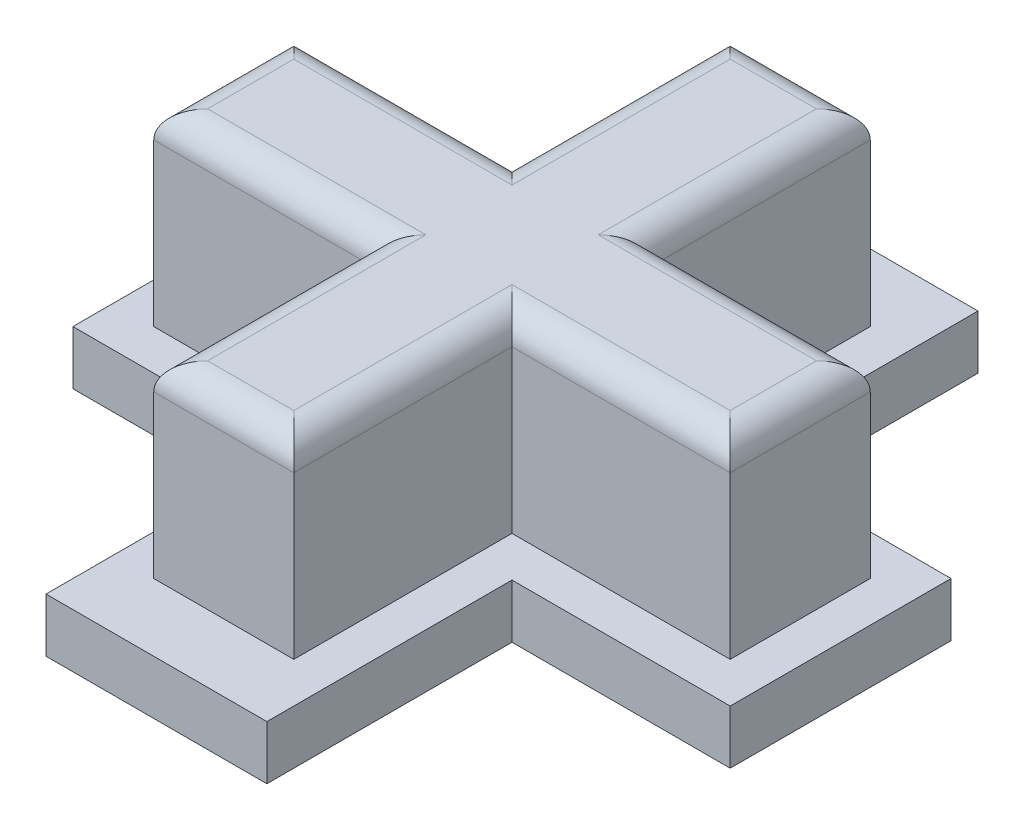
ISO-10303-21;
HEADER;
FILE_DESCRIPTION(('STEP AP214'),'2;1');
FILE_NAME('part.step','',(''),(''),'','','');
FILE_SCHEMA(('AUTOMOTIVE_DESIGN { 1 0 10303 214 1 1 1 1 }'));
ENDSEC;
DATA;
#1=APPLICATION_CONTEXT('core data for automotive mechanical design processes');
#2=APPLICATION_PROTOCOL_DEFINITION('international standard','automotive_design',2000,#1);
#3=PRODUCT_CONTEXT('',#1,'mechanical');
#4=PRODUCT('Part','Part','',(#3));
#5=PRODUCT_RELATED_PRODUCT_CATEGORY('part','',(#4));
#6=PRODUCT_DEFINITION_FORMATION('','',#4);
#7=PRODUCT_DEFINITION_CONTEXT('part definition',#1,'design');
#8=PRODUCT_DEFINITION('design','',#6,#7);
#9=PRODUCT_DEFINITION_SHAPE('','',#8);
#10=(LENGTH_UNIT() NAMED_UNIT(*) SI_UNIT(.MILLI.,.METRE.));
#11=(NAMED_UNIT(*) PLANE_ANGLE_UNIT() SI_UNIT($,.RADIAN.));
#12=(NAMED_UNIT(*) SI_UNIT($,.STERADIAN.) SOLID_ANGLE_UNIT());
#13=UNCERTAINTY_MEASURE_WITH_UNIT(LENGTH_MEASURE(1.E-05),#10,'distance_accuracy_value','');
#14=(GEOMETRIC_REPRESENTATION_CONTEXT(3) GLOBAL_UNCERTAINTY_ASSIGNED_CONTEXT((#13)) GLOBAL_UNIT_ASSIGNED_CONTEXT((#10,
#11,#12)) REPRESENTATION_CONTEXT('',''));
#15=CARTESIAN_POINT('',(0.,0.,0.));
#16=DIRECTION('',(0.,0.,1.));
#17=DIRECTION('',(1.,0.,0.));
#18=AXIS2_PLACEMENT_3D('',#15,#16,#17);
#19=CARTESIAN_POINT('',(0.,2.,0.));
#20=DIRECTION('',(0.,1.,0.));
#21=DIRECTION('',(0.,0.,1.));
#22=AXIS2_PLACEMENT_3D('',#19,#20,#21);
#23=PLANE('',#22);
#24=DIRECTION('',(0.,0.,1.));
#25=VECTOR('',#24,1.);
#26=CARTESIAN_POINT('',(4.1,2.,0.));
#27=LINE('',#26,#25);
#28=CARTESIAN_POINT('',(4.1,2.,4.1));
#29=VERTEX_POINT('',#28);
#30=CARTESIAN_POINT('',(4.1,2.,13.2));
#31=VERTEX_POINT('',#30);
#32=EDGE_CURVE('E308',#29,#31,#27,.T.);
#33=ORIENTED_EDGE('',*,*,#32,.F.);
#34=DIRECTION('',(-1.,0.,0.));
#35=VECTOR('',#34,1.);
#36=CARTESIAN_POINT('',(0.,2.,4.1));
#37=LINE('',#36,#35);
#38=CARTESIAN_POINT('',(12.2,2.,4.1));
#39=VERTEX_POINT('',#38);
#40=EDGE_CURVE('E311',#39,#29,#37,.T.);
#41=ORIENTED_EDGE('',*,*,#40,.F.);
#42=DIRECTION('',(0.,0.,1.));
#43=VECTOR('',#42,1.);
#44=CARTESIAN_POINT('',(12.2,2.,0.));
#45=LINE('',#44,#43);
#46=CARTESIAN_POINT('',(12.2,2.,-4.1));
#47=VERTEX_POINT('',#46);
#48=EDGE_CURVE('E315',#47,#39,#45,.T.);
#49=ORIENTED_EDGE('',*,*,#48,.F.);
#50=DIRECTION('',(-1.,0.,0.));
#51=VECTOR('',#50,1.);
#52=CARTESIAN_POINT('',(0.,2.,-4.1));
#53=LINE('',#52,#51);
#54=CARTESIAN_POINT('',(4.1,2.,-4.1));
#55=VERTEX_POINT('',#54);
#56=EDGE_CURVE('E318',#47,#55,#53,.T.);
#57=ORIENTED_EDGE('',*,*,#56,.T.);
#58=DIRECTION('',(0.,0.,1.));
#59=VECTOR('',#58,1.);
#60=CARTESIAN_POINT('',(4.1,2.,0.));
#61=LINE('',#60,#59);
#62=CARTESIAN_POINT('',(4.1,2.,-13.2));
#63=VERTEX_POINT('',#62);
#64=EDGE_CURVE('E320',#63,#55,#61,.T.);
#65=ORIENTED_EDGE('',*,*,#64,.F.);
#66=DIRECTION('',(1.,0.,0.));
#67=VECTOR('',#66,1.);
#68=CARTESIAN_POINT('',(0.,2.,-13.2));
#69=LINE('',#68,#67);
#70=CARTESIAN_POINT('',(-4.1,2.,-13.2));
#71=VERTEX_POINT('',#70);
#72=EDGE_CURVE('E323',#71,#63,#69,.T.);
#73=ORIENTED_EDGE('',*,*,#72,.F.);
#74=DIRECTION('',(0.,0.,1.));
#75=VECTOR('',#74,1.);
#76=CARTESIAN_POINT('',(-4.1,2.,0.));
#77=LINE('',#76,#75);
#78=CARTESIAN_POINT('',(-4.1,2.,-4.1));
#79=VERTEX_POINT('',#78);
#80=EDGE_CURVE('E326',#71,#79,#77,.T.);
#81=ORIENTED_EDGE('',*,*,#80,.T.);
#82=DIRECTION('',(-1.,0.,0.));
#83=VECTOR('',#82,1.);
#84=CARTESIAN_POINT('',(0.,2.,-4.1));
#85=LINE('',#84,#83);
#86=CARTESIAN_POINT('',(-12.2,2.,-4.1));
#87=VERTEX_POINT('',#86);
#88=EDGE_CURVE('E328',#79,#87,#85,.T.);
#89=ORIENTED_EDGE('',*,*,#88,.T.);
#90=DIRECTION('',(0.,0.,1.));
#91=VECTOR('',#90,1.);
#92=CARTESIAN_POINT('',(-12.2,2.,0.));
#93=LINE('',#92,#91);
#94=CARTESIAN_POINT('',(-12.2,2.,4.1));
#95=VERTEX_POINT('',#94);
#96=EDGE_CURVE('E330',#87,#95,#93,.T.);
#97=ORIENTED_EDGE('',*,*,#96,.T.);
#98=DIRECTION('',(1.,0.,0.));
#99=VECTOR('',#98,1.);
#100=CARTESIAN_POINT('',(0.,2.,4.1));
#101=LINE('',#100,#99);
#102=CARTESIAN_POINT('',(-4.1,2.,4.1));
#103=VERTEX_POINT('',#102);
#104=EDGE_CURVE('E332',#95,#103,#101,.T.);
#105=ORIENTED_EDGE('',*,*,#104,.T.);
#106=DIRECTION('',(0.,0.,1.));
#107=VECTOR('',#106,1.);
#108=CARTESIAN_POINT('',(-4.1,2.,0.));
#109=LINE('',#108,#107);
#110=CARTESIAN_POINT('',(-4.1,2.,13.2));
#111=VERTEX_POINT('',#110);
#112=EDGE_CURVE('E334',#103,#111,#109,.T.);
#113=ORIENTED_EDGE('',*,*,#112,.T.);
#114=DIRECTION('',(1.,0.,0.));
#115=VECTOR('',#114,1.);
#116=CARTESIAN_POINT('',(0.,2.,13.2));
#117=LINE('',#116,#115);
#118=EDGE_CURVE('E336',#111,#31,#117,.T.);
#119=ORIENTED_EDGE('',*,*,#118,.T.);
#120=EDGE_LOOP('',(#33,#41,#49,#57,#65,#73,#81,#89,#97,#105,#113,#119));
#121=FACE_BOUND('',#120,.T.);
#122=DIRECTION('',(-1.,0.,0.));
#123=VECTOR('',#122,1.);
#124=CARTESIAN_POINT('',(2.6,2.,-10.7));
#125=LINE('',#124,#123);
#126=CARTESIAN_POINT('',(2.6,2.,-10.7));
#127=VERTEX_POINT('',#126);
#128=CARTESIAN_POINT('',(-2.6,2.,-10.7));
#129=VERTEX_POINT('',#128);
#130=EDGE_CURVE('E257',#127,#129,#125,.T.);
#131=ORIENTED_EDGE('',*,*,#130,.F.);
#132=DIRECTION('',(0.,0.,-1.));
#133=VECTOR('',#132,1.);
#134=CARTESIAN_POINT('',(2.6,2.,-10.7));
#135=LINE('',#134,#133);
#136=CARTESIAN_POINT('',(2.6,2.,-2.6));
#137=VERTEX_POINT('',#136);
#138=EDGE_CURVE('E238',#137,#127,#135,.T.);
#139=ORIENTED_EDGE('',*,*,#138,.F.);
#140=DIRECTION('',(-1.,0.,0.));
#141=VECTOR('',#140,1.);
#142=CARTESIAN_POINT('',(10.7,2.,-2.6));
#143=LINE('',#142,#141);
#144=CARTESIAN_POINT('',(10.7,2.,-2.6));
#145=VERTEX_POINT('',#144);
#146=EDGE_CURVE('E247',#145,#137,#143,.T.);
#147=ORIENTED_EDGE('',*,*,#146,.F.);
#148=DIRECTION('',(0.,0.,-1.));
#149=VECTOR('',#148,1.);
#150=CARTESIAN_POINT('',(10.7,2.,2.6));
#151=LINE('',#150,#149);
#152=CARTESIAN_POINT('',(10.7,2.,2.6));
#153=VERTEX_POINT('',#152);
#154=EDGE_CURVE('E253',#153,#145,#151,.T.);
#155=ORIENTED_EDGE('',*,*,#154,.F.);
#156=DIRECTION('',(1.,0.,0.));
#157=VECTOR('',#156,1.);
#158=CARTESIAN_POINT('',(10.7,2.,2.6));
#159=LINE('',#158,#157);
#160=CARTESIAN_POINT('',(2.6,2.,2.6));
#161=VERTEX_POINT('',#160);
#162=EDGE_CURVE('E284',#161,#153,#159,.T.);
#163=ORIENTED_EDGE('',*,*,#162,.F.);
#164=DIRECTION('',(0.,0.,-1.));
#165=VECTOR('',#164,1.);
#166=CARTESIAN_POINT('',(2.6,2.,2.6));
#167=LINE('',#166,#165);
#168=CARTESIAN_POINT('',(2.6,2.,10.7));
#169=VERTEX_POINT('',#168);
#170=EDGE_CURVE('E281',#169,#161,#167,.T.);
#171=ORIENTED_EDGE('',*,*,#170,.F.);
#172=DIRECTION('',(1.,0.,0.));
#173=VECTOR('',#172,1.);
#174=CARTESIAN_POINT('',(2.6,2.,10.7));
#175=LINE('',#174,#173);
#176=CARTESIAN_POINT('',(-2.6,2.,10.7));
#177=VERTEX_POINT('',#176);
#178=EDGE_CURVE('E278',#177,#169,#175,.T.);
#179=ORIENTED_EDGE('',*,*,#178,.F.);
#180=DIRECTION('',(0.,0.,1.));
#181=VECTOR('',#180,1.);
#182=CARTESIAN_POINT('',(-2.6,2.,2.6));
#183=LINE('',#182,#181);
#184=CARTESIAN_POINT('',(-2.6,2.,2.6));
#185=VERTEX_POINT('',#184);
#186=EDGE_CURVE('E275',#185,#177,#183,.T.);
#187=ORIENTED_EDGE('',*,*,#186,.F.);
#188=DIRECTION('',(1.,0.,0.));
#189=VECTOR('',#188,1.);
#190=CARTESIAN_POINT('',(-2.6,2.,2.6));
#191=LINE('',#190,#189);
#192=CARTESIAN_POINT('',(-10.7,2.,2.6));
#193=VERTEX_POINT('',#192);
#194=EDGE_CURVE('E272',#193,#185,#191,.T.);
#195=ORIENTED_EDGE('',*,*,#194,.F.);
#196=DIRECTION('',(0.,0.,1.));
#197=VECTOR('',#196,1.);
#198=CARTESIAN_POINT('',(-10.7,2.,2.6));
#199=LINE('',#198,#197);
#200=CARTESIAN_POINT('',(-10.7,2.,-2.6));
#201=VERTEX_POINT('',#200);
#202=EDGE_CURVE('E269',#201,#193,#199,.T.);
#203=ORIENTED_EDGE('',*,*,#202,.F.);
#204=DIRECTION('',(-1.,0.,0.));
#205=VECTOR('',#204,1.);
#206=CARTESIAN_POINT('',(-5.5,2.,-2.6));
#207=LINE('',#206,#205);
#208=CARTESIAN_POINT('',(-2.6,2.,-2.6));
#209=VERTEX_POINT('',#208);
#210=EDGE_CURVE('E266',#209,#201,#207,.T.);
#211=ORIENTED_EDGE('',*,*,#210,.F.);
#212=DIRECTION('',(0.,0.,1.));
#213=VECTOR('',#212,1.);
#214=CARTESIAN_POINT('',(-2.6,2.,-10.7));
#215=LINE('',#214,#213);
#216=EDGE_CURVE('E259',#129,#209,#215,.T.);
#217=ORIENTED_EDGE('',*,*,#216,.F.);
#218=EDGE_LOOP('',(#131,#139,#147,#155,#163,#171,#179,#187,#195,#203,#211,#217));
#219=FACE_BOUND('',#218,.T.);
#220=ADVANCED_FACE('F35',(#121,#219),#23,.T.);
#221=CARTESIAN_POINT('',(4.1,2.,0.));
#222=DIRECTION('',(1.,0.,0.));
#223=DIRECTION('',(0.,0.,-1.));
#224=AXIS2_PLACEMENT_3D('',#221,#222,#223);
#225=PLANE('',#224);
#226=DIRECTION('',(0.,0.,1.));
#227=VECTOR('',#226,1.);
#228=CARTESIAN_POINT('',(4.1,0.,0.));
#229=LINE('',#228,#227);
#230=CARTESIAN_POINT('',(4.1,0.,4.1));
#231=VERTEX_POINT('',#230);
#232=CARTESIAN_POINT('',(4.1,0.,13.2));
#233=VERTEX_POINT('',#232);
#234=EDGE_CURVE('E243',#231,#233,#229,.T.);
#235=ORIENTED_EDGE('',*,*,#234,.F.);
#236=DIRECTION('',(0.,-1.,0.));
#237=VECTOR('',#236,1.);
#238=CARTESIAN_POINT('',(4.1,2.,4.1));
#239=LINE('',#238,#237);
#240=EDGE_CURVE('E394',#29,#231,#239,.T.);
#241=ORIENTED_EDGE('',*,*,#240,.F.);
#242=ORIENTED_EDGE('',*,*,#32,.T.);
#243=DIRECTION('',(0.,-1.,0.));
#244=VECTOR('',#243,1.);
#245=CARTESIAN_POINT('',(4.1,2.,13.2));
#246=LINE('',#245,#244);
#247=EDGE_CURVE('E338',#31,#233,#246,.T.);
#248=ORIENTED_EDGE('',*,*,#247,.T.);
#249=EDGE_LOOP('',(#235,#241,#242,#248));
#250=FACE_BOUND('',#249,.T.);
#251=ADVANCED_FACE('F508',(#250),#225,.T.);
#252=CARTESIAN_POINT('',(0.,2.,4.1));
#253=DIRECTION('',(0.,0.,1.));
#254=DIRECTION('',(1.,0.,0.));
#255=AXIS2_PLACEMENT_3D('',#252,#253,#254);
#256=PLANE('',#255);
#257=DIRECTION('',(-1.,0.,0.));
#258=VECTOR('',#257,1.);
#259=CARTESIAN_POINT('',(0.,0.,4.1));
#260=LINE('',#259,#258);
#261=CARTESIAN_POINT('',(12.2,0.,4.1));
#262=VERTEX_POINT('',#261);
#263=EDGE_CURVE('E341',#262,#231,#260,.T.);
#264=ORIENTED_EDGE('',*,*,#263,.F.);
#265=DIRECTION('',(0.,-1.,0.));
#266=VECTOR('',#265,1.);
#267=CARTESIAN_POINT('',(12.2,2.,4.1));
#268=LINE('',#267,#266);
#269=EDGE_CURVE('E392',#39,#262,#268,.T.);
#270=ORIENTED_EDGE('',*,*,#269,.F.);
#271=ORIENTED_EDGE('',*,*,#40,.T.);
#272=ORIENTED_EDGE('',*,*,#240,.T.);
#273=EDGE_LOOP('',(#264,#270,#271,#272));
#274=FACE_BOUND('',#273,.T.);
#275=ADVANCED_FACE('F514',(#274),#256,.T.);
#276=CARTESIAN_POINT('',(12.2,2.,0.));
#277=DIRECTION('',(1.,0.,0.));
#278=DIRECTION('',(0.,0.,-1.));
#279=AXIS2_PLACEMENT_3D('',#276,#277,#278);
#280=PLANE('',#279);
#281=DIRECTION('',(0.,0.,1.));
#282=VECTOR('',#281,1.);
#283=CARTESIAN_POINT('',(12.2,0.,0.));
#284=LINE('',#283,#282);
#285=CARTESIAN_POINT('',(12.2,0.,-4.1));
#286=VERTEX_POINT('',#285);
#287=EDGE_CURVE('E344',#286,#262,#284,.T.);
#288=ORIENTED_EDGE('',*,*,#287,.F.);
#289=DIRECTION('',(0.,-1.,0.));
#290=VECTOR('',#289,1.);
#291=CARTESIAN_POINT('',(12.2,2.,-4.1));
#292=LINE('',#291,#290);
#293=EDGE_CURVE('E390',#47,#286,#292,.T.);
#294=ORIENTED_EDGE('',*,*,#293,.F.);
#295=ORIENTED_EDGE('',*,*,#48,.T.);
#296=ORIENTED_EDGE('',*,*,#269,.T.);
#297=EDGE_LOOP('',(#288,#294,#295,#296));
#298=FACE_BOUND('',#297,.T.);
#299=ADVANCED_FACE('F560',(#298),#280,.T.);
#300=CARTESIAN_POINT('',(0.,2.,-4.1));
#301=DIRECTION('',(0.,0.,1.));
#302=DIRECTION('',(1.,0.,0.));
#303=AXIS2_PLACEMENT_3D('',#300,#301,#302);
#304=PLANE('',#303);
#305=DIRECTION('',(-1.,0.,0.));
#306=VECTOR('',#305,1.);
#307=CARTESIAN_POINT('',(0.,0.,-4.1));
#308=LINE('',#307,#306);
#309=CARTESIAN_POINT('',(4.1,0.,-4.1));
#310=VERTEX_POINT('',#309);
#311=EDGE_CURVE('E347',#286,#310,#308,.T.);
#312=ORIENTED_EDGE('',*,*,#311,.T.);
#313=DIRECTION('',(0.,-1.,0.));
#314=VECTOR('',#313,1.);
#315=CARTESIAN_POINT('',(4.1,2.,-4.1));
#316=LINE('',#315,#314);
#317=EDGE_CURVE('E388',#55,#310,#316,.T.);
#318=ORIENTED_EDGE('',*,*,#317,.F.);
#319=ORIENTED_EDGE('',*,*,#56,.F.);
#320=ORIENTED_EDGE('',*,*,#293,.T.);
#321=EDGE_LOOP('',(#312,#318,#319,#320));
#322=FACE_BOUND('',#321,.T.);
#323=ADVANCED_FACE('F556',(#322),#304,.F.);
#324=CARTESIAN_POINT('',(4.1,2.,0.));
#325=DIRECTION('',(1.,0.,0.));
#326=DIRECTION('',(0.,0.,-1.));
#327=AXIS2_PLACEMENT_3D('',#324,#325,#326);
#328=PLANE('',#327);
#329=DIRECTION('',(0.,0.,1.));
#330=VECTOR('',#329,1.);
#331=CARTESIAN_POINT('',(4.1,0.,0.));
#332=LINE('',#331,#330);
#333=CARTESIAN_POINT('',(4.1,0.,-13.2));
#334=VERTEX_POINT('',#333);
#335=EDGE_CURVE('E350',#334,#310,#332,.T.);
#336=ORIENTED_EDGE('',*,*,#335,.F.);
#337=DIRECTION('',(0.,-1.,0.));
#338=VECTOR('',#337,1.);
#339=CARTESIAN_POINT('',(4.1,2.,-13.2));
#340=LINE('',#339,#338);
#341=EDGE_CURVE('E386',#63,#334,#340,.T.);
#342=ORIENTED_EDGE('',*,*,#341,.F.);
#343=ORIENTED_EDGE('',*,*,#64,.T.);
#344=ORIENTED_EDGE('',*,*,#317,.T.);
#345=EDGE_LOOP('',(#336,#342,#343,#344));
#346=FACE_BOUND('',#345,.T.);
#347=ADVANCED_FACE('F552',(#346),#328,.T.);
#348=CARTESIAN_POINT('',(0.,2.,-13.2));
#349=DIRECTION('',(0.,0.,-1.));
#350=DIRECTION('',(-1.,0.,0.));
#351=AXIS2_PLACEMENT_3D('',#348,#349,#350);
#352=PLANE('',#351);
#353=DIRECTION('',(1.,0.,0.));
#354=VECTOR('',#353,1.);
#355=CARTESIAN_POINT('',(0.,0.,-13.2));
#356=LINE('',#355,#354);
#357=CARTESIAN_POINT('',(-4.1,0.,-13.2));
#358=VERTEX_POINT('',#357);
#359=EDGE_CURVE('E353',#358,#334,#356,.T.);
#360=ORIENTED_EDGE('',*,*,#359,.F.);
#361=DIRECTION('',(0.,-1.,0.));
#362=VECTOR('',#361,1.);
#363=CARTESIAN_POINT('',(-4.1,2.,-13.2));
#364=LINE('',#363,#362);
#365=EDGE_CURVE('E384',#71,#358,#364,.T.);
#366=ORIENTED_EDGE('',*,*,#365,.F.);
#367=ORIENTED_EDGE('',*,*,#72,.T.);
#368=ORIENTED_EDGE('',*,*,#341,.T.);
#369=EDGE_LOOP('',(#360,#366,#367,#368));
#370=FACE_BOUND('',#369,.T.);
#371=ADVANCED_FACE('F548',(#370),#352,.T.);
#372=CARTESIAN_POINT('',(-4.1,2.,0.));
#373=DIRECTION('',(1.,0.,0.));
#374=DIRECTION('',(0.,0.,-1.));
#375=AXIS2_PLACEMENT_3D('',#372,#373,#374);
#376=PLANE('',#375);
#377=DIRECTION('',(0.,0.,1.));
#378=VECTOR('',#377,1.);
#379=CARTESIAN_POINT('',(-4.1,0.,0.));
#380=LINE('',#379,#378);
#381=CARTESIAN_POINT('',(-4.1,0.,-4.1));
#382=VERTEX_POINT('',#381);
#383=EDGE_CURVE('E356',#358,#382,#380,.T.);
#384=ORIENTED_EDGE('',*,*,#383,.T.);
#385=DIRECTION('',(0.,-1.,0.));
#386=VECTOR('',#385,1.);
#387=CARTESIAN_POINT('',(-4.1,2.,-4.1));
#388=LINE('',#387,#386);
#389=EDGE_CURVE('E381',#79,#382,#388,.T.);
#390=ORIENTED_EDGE('',*,*,#389,.F.);
#391=ORIENTED_EDGE('',*,*,#80,.F.);
#392=ORIENTED_EDGE('',*,*,#365,.T.);
#393=EDGE_LOOP('',(#384,#390,#391,#392));
#394=FACE_BOUND('',#393,.T.);
#395=ADVANCED_FACE('F544',(#394),#376,.F.);
#396=CARTESIAN_POINT('',(0.,2.,-4.1));
#397=DIRECTION('',(0.,0.,1.));
#398=DIRECTION('',(1.,0.,0.));
#399=AXIS2_PLACEMENT_3D('',#396,#397,#398);
#400=PLANE('',#399);
#401=DIRECTION('',(-1.,0.,0.));
#402=VECTOR('',#401,1.);
#403=CARTESIAN_POINT('',(0.,0.,-4.1));
#404=LINE('',#403,#402);
#405=CARTESIAN_POINT('',(-12.2,0.,-4.1));
#406=VERTEX_POINT('',#405);
#407=EDGE_CURVE('E358',#382,#406,#404,.T.);
#408=ORIENTED_EDGE('',*,*,#407,.T.);
#409=DIRECTION('',(0.,-1.,0.));
#410=VECTOR('',#409,1.);
#411=CARTESIAN_POINT('',(-12.2,2.,-4.1));
#412=LINE('',#411,#410);
#413=EDGE_CURVE('E378',#87,#406,#412,.T.);
#414=ORIENTED_EDGE('',*,*,#413,.F.);
#415=ORIENTED_EDGE('',*,*,#88,.F.);
#416=ORIENTED_EDGE('',*,*,#389,.T.);
#417=EDGE_LOOP('',(#408,#414,#415,#416));
#418=FACE_BOUND('',#417,.T.);
#419=ADVANCED_FACE('F540',(#418),#400,.F.);
#420=CARTESIAN_POINT('',(-12.2,2.,0.));
#421=DIRECTION('',(1.,0.,0.));
#422=DIRECTION('',(0.,0.,-1.));
#423=AXIS2_PLACEMENT_3D('',#420,#421,#422);
#424=PLANE('',#423);
#425=DIRECTION('',(0.,0.,1.));
#426=VECTOR('',#425,1.);
#427=CARTESIAN_POINT('',(-12.2,0.,0.));
#428=LINE('',#427,#426);
#429=CARTESIAN_POINT('',(-12.2,0.,4.1));
#430=VERTEX_POINT('',#429);
#431=EDGE_CURVE('E360',#406,#430,#428,.T.);
#432=ORIENTED_EDGE('',*,*,#431,.T.);
#433=DIRECTION('',(0.,-1.,0.));
#434=VECTOR('',#433,1.);
#435=CARTESIAN_POINT('',(-12.2,2.,4.1));
#436=LINE('',#435,#434);
#437=EDGE_CURVE('E375',#95,#430,#436,.T.);
#438=ORIENTED_EDGE('',*,*,#437,.F.);
#439=ORIENTED_EDGE('',*,*,#96,.F.);
#440=ORIENTED_EDGE('',*,*,#413,.T.);
#441=EDGE_LOOP('',(#432,#438,#439,#440));
#442=FACE_BOUND('',#441,.T.);
#443=ADVANCED_FACE('F536',(#442),#424,.F.);
#444=CARTESIAN_POINT('',(0.,2.,4.1));
#445=DIRECTION('',(0.,0.,-1.));
#446=DIRECTION('',(-1.,0.,0.));
#447=AXIS2_PLACEMENT_3D('',#444,#445,#446);
#448=PLANE('',#447);
#449=DIRECTION('',(1.,0.,0.));
#450=VECTOR('',#449,1.);
#451=CARTESIAN_POINT('',(0.,0.,4.1));
#452=LINE('',#451,#450);
#453=CARTESIAN_POINT('',(-4.1,0.,4.1));
#454=VERTEX_POINT('',#453);
#455=EDGE_CURVE('E362',#430,#454,#452,.T.);
#456=ORIENTED_EDGE('',*,*,#455,.T.);
#457=DIRECTION('',(0.,-1.,0.));
#458=VECTOR('',#457,1.);
#459=CARTESIAN_POINT('',(-4.1,2.,4.1));
#460=LINE('',#459,#458);
#461=EDGE_CURVE('E372',#103,#454,#460,.T.);
#462=ORIENTED_EDGE('',*,*,#461,.F.);
#463=ORIENTED_EDGE('',*,*,#104,.F.);
#464=ORIENTED_EDGE('',*,*,#437,.T.);
#465=EDGE_LOOP('',(#456,#462,#463,#464));
#466=FACE_BOUND('',#465,.T.);
#467=ADVANCED_FACE('F532',(#466),#448,.F.);
#468=CARTESIAN_POINT('',(-4.1,2.,0.));
#469=DIRECTION('',(1.,0.,0.));
#470=DIRECTION('',(0.,0.,-1.));
#471=AXIS2_PLACEMENT_3D('',#468,#469,#470);
#472=PLANE('',#471);
#473=DIRECTION('',(0.,0.,1.));
#474=VECTOR('',#473,1.);
#475=CARTESIAN_POINT('',(-4.1,0.,0.));
#476=LINE('',#475,#474);
#477=CARTESIAN_POINT('',(-4.1,0.,13.2));
#478=VERTEX_POINT('',#477);
#479=EDGE_CURVE('E364',#454,#478,#476,.T.);
#480=ORIENTED_EDGE('',*,*,#479,.T.);
#481=DIRECTION('',(0.,-1.,0.));
#482=VECTOR('',#481,1.);
#483=CARTESIAN_POINT('',(-4.1,2.,13.2));
#484=LINE('',#483,#482);
#485=EDGE_CURVE('E369',#111,#478,#484,.T.);
#486=ORIENTED_EDGE('',*,*,#485,.F.);
#487=ORIENTED_EDGE('',*,*,#112,.F.);
#488=ORIENTED_EDGE('',*,*,#461,.T.);
#489=EDGE_LOOP('',(#480,#486,#487,#488));
#490=FACE_BOUND('',#489,.T.);
#491=ADVANCED_FACE('F528',(#490),#472,.F.);
#492=CARTESIAN_POINT('',(0.,2.,13.2));
#493=DIRECTION('',(0.,0.,-1.));
#494=DIRECTION('',(-1.,0.,0.));
#495=AXIS2_PLACEMENT_3D('',#492,#493,#494);
#496=PLANE('',#495);
#497=DIRECTION('',(1.,0.,0.));
#498=VECTOR('',#497,1.);
#499=CARTESIAN_POINT('',(0.,0.,13.2));
#500=LINE('',#499,#498);
#501=EDGE_CURVE('E312',#478,#233,#500,.T.);
#502=ORIENTED_EDGE('',*,*,#501,.T.);
#503=ORIENTED_EDGE('',*,*,#247,.F.);
#504=ORIENTED_EDGE('',*,*,#118,.F.);
#505=ORIENTED_EDGE('',*,*,#485,.T.);
#506=EDGE_LOOP('',(#502,#503,#504,#505));
#507=FACE_BOUND('',#506,.T.);
#508=ADVANCED_FACE('F524',(#507),#496,.F.);
#509=CARTESIAN_POINT('',(0.,0.,0.));
#510=DIRECTION('',(0.,1.,0.));
#511=DIRECTION('',(0.,0.,1.));
#512=AXIS2_PLACEMENT_3D('',#509,#510,#511);
#513=PLANE('',#512);
#514=ORIENTED_EDGE('',*,*,#234,.T.);
#515=ORIENTED_EDGE('',*,*,#501,.F.);
#516=ORIENTED_EDGE('',*,*,#479,.F.);
#517=ORIENTED_EDGE('',*,*,#455,.F.);
#518=ORIENTED_EDGE('',*,*,#431,.F.);
#519=ORIENTED_EDGE('',*,*,#407,.F.);
#520=ORIENTED_EDGE('',*,*,#383,.F.);
#521=ORIENTED_EDGE('',*,*,#359,.T.);
#522=ORIENTED_EDGE('',*,*,#335,.T.);
#523=ORIENTED_EDGE('',*,*,#311,.F.);
#524=ORIENTED_EDGE('',*,*,#287,.T.);
#525=ORIENTED_EDGE('',*,*,#263,.T.);
#526=EDGE_LOOP('',(#514,#515,#516,#517,#518,#519,#520,#521,#522,#523,#524,#525));
#527=FACE_BOUND('',#526,.T.);
#528=ADVANCED_FACE('F521',(#527),#513,.F.);
#529=CARTESIAN_POINT('',(2.6,9.,-10.7));
#530=DIRECTION('',(-1.,0.,0.));
#531=DIRECTION('',(0.,0.,1.));
#532=AXIS2_PLACEMENT_3D('',#529,#530,#531);
#533=PLANE('',#532);
#534=DIRECTION('',(0.,-1.,0.));
#535=VECTOR('',#534,1.);
#536=CARTESIAN_POINT('',(2.6,9.,-10.7));
#537=LINE('',#536,#535);
#538=CARTESIAN_POINT('',(2.6,8.,-10.7));
#539=VERTEX_POINT('',#538);
#540=EDGE_CURVE('E244',#539,#127,#537,.T.);
#541=ORIENTED_EDGE('',*,*,#540,.F.);
#542=DIRECTION('',(0.,0.,-1.));
#543=VECTOR('',#542,1.);
#544=CARTESIAN_POINT('',(2.6,8.,-2.6));
#545=LINE('',#544,#543);
#546=CARTESIAN_POINT('',(2.6,8.,-2.6));
#547=VERTEX_POINT('',#546);
#548=EDGE_CURVE('E241',#539,#547,#545,.F.);
#549=ORIENTED_EDGE('',*,*,#548,.T.);
#550=DIRECTION('',(0.,-1.,0.));
#551=VECTOR('',#550,1.);
#552=CARTESIAN_POINT('',(2.6,9.,-2.6));
#553=LINE('',#552,#551);
#554=EDGE_CURVE('E233',#547,#137,#553,.T.);
#555=ORIENTED_EDGE('',*,*,#554,.T.);
#556=ORIENTED_EDGE('',*,*,#138,.T.);
#557=EDGE_LOOP('',(#541,#549,#555,#556));
#558=FACE_BOUND('',#557,.T.);
#559=ADVANCED_FACE('F236',(#558),#533,.F.);
#560=CARTESIAN_POINT('',(2.6,9.,-10.7));
#561=DIRECTION('',(0.,0.,1.));
#562=DIRECTION('',(1.,0.,0.));
#563=AXIS2_PLACEMENT_3D('',#560,#561,#562);
#564=PLANE('',#563);
#565=DIRECTION('',(0.,-1.,0.));
#566=VECTOR('',#565,1.);
#567=CARTESIAN_POINT('',(-2.6,9.,-10.7));
#568=LINE('',#567,#566);
#569=CARTESIAN_POINT('',(-2.6,8.,-10.7));
#570=VERTEX_POINT('',#569);
#571=EDGE_CURVE('E305',#570,#129,#568,.T.);
#572=ORIENTED_EDGE('',*,*,#571,.F.);
#573=DIRECTION('',(-1.,0.,0.));
#574=VECTOR('',#573,1.);
#575=CARTESIAN_POINT('',(2.6,8.,-10.7));
#576=LINE('',#575,#574);
#577=EDGE_CURVE('E433',#570,#539,#576,.F.);
#578=ORIENTED_EDGE('',*,*,#577,.T.);
#579=ORIENTED_EDGE('',*,*,#540,.T.);
#580=ORIENTED_EDGE('',*,*,#130,.T.);
#581=EDGE_LOOP('',(#572,#578,#579,#580));
#582=FACE_BOUND('',#581,.T.);
#583=ADVANCED_FACE('F650',(#582),#564,.F.);
#584=CARTESIAN_POINT('',(-2.6,9.,-10.7));
#585=DIRECTION('',(1.,0.,0.));
#586=DIRECTION('',(0.,0.,-1.));
#587=AXIS2_PLACEMENT_3D('',#584,#585,#586);
#588=PLANE('',#587);
#589=DIRECTION('',(0.,-1.,0.));
#590=VECTOR('',#589,1.);
#591=CARTESIAN_POINT('',(-2.6,9.,-2.6));
#592=LINE('',#591,#590);
#593=CARTESIAN_POINT('',(-2.6,8.,-2.6));
#594=VERTEX_POINT('',#593);
#595=EDGE_CURVE('E303',#594,#209,#592,.T.);
#596=ORIENTED_EDGE('',*,*,#595,.F.);
#597=DIRECTION('',(0.,0.,1.));
#598=VECTOR('',#597,1.);
#599=CARTESIAN_POINT('',(-2.6,8.,-10.7));
#600=LINE('',#599,#598);
#601=EDGE_CURVE('E426',#594,#570,#600,.F.);
#602=ORIENTED_EDGE('',*,*,#601,.T.);
#603=ORIENTED_EDGE('',*,*,#571,.T.);
#604=ORIENTED_EDGE('',*,*,#216,.T.);
#605=EDGE_LOOP('',(#596,#602,#603,#604));
#606=FACE_BOUND('',#605,.T.);
#607=ADVANCED_FACE('F647',(#606),#588,.F.);
#608=CARTESIAN_POINT('',(-5.5,9.,-2.6));
#609=DIRECTION('',(0.,0.,1.));
#610=DIRECTION('',(1.,0.,0.));
#611=AXIS2_PLACEMENT_3D('',#608,#609,#610);
#612=PLANE('',#611);
#613=DIRECTION('',(0.,-1.,0.));
#614=VECTOR('',#613,1.);
#615=CARTESIAN_POINT('',(-10.7,9.,-2.6));
#616=LINE('',#615,#614);
#617=CARTESIAN_POINT('',(-10.7,8.,-2.6));
#618=VERTEX_POINT('',#617);
#619=EDGE_CURVE('E301',#618,#201,#616,.T.);
#620=ORIENTED_EDGE('',*,*,#619,.F.);
#621=DIRECTION('',(-1.,0.,0.));
#622=VECTOR('',#621,1.);
#623=CARTESIAN_POINT('',(-2.6,8.,-2.6));
#624=LINE('',#623,#622);
#625=EDGE_CURVE('E431',#618,#594,#624,.F.);
#626=ORIENTED_EDGE('',*,*,#625,.T.);
#627=ORIENTED_EDGE('',*,*,#595,.T.);
#628=ORIENTED_EDGE('',*,*,#210,.T.);
#629=EDGE_LOOP('',(#620,#626,#627,#628));
#630=FACE_BOUND('',#629,.T.);
#631=ADVANCED_FACE('F644',(#630),#612,.F.);
#632=CARTESIAN_POINT('',(-10.7,9.,2.6));
#633=DIRECTION('',(1.,0.,0.));
#634=DIRECTION('',(0.,0.,-1.));
#635=AXIS2_PLACEMENT_3D('',#632,#633,#634);
#636=PLANE('',#635);
#637=DIRECTION('',(0.,-1.,0.));
#638=VECTOR('',#637,1.);
#639=CARTESIAN_POINT('',(-10.7,9.,2.6));
#640=LINE('',#639,#638);
#641=CARTESIAN_POINT('',(-10.7,8.,2.6));
#642=VERTEX_POINT('',#641);
#643=EDGE_CURVE('E299',#642,#193,#640,.T.);
#644=ORIENTED_EDGE('',*,*,#643,.F.);
#645=DIRECTION('',(0.,0.,1.));
#646=VECTOR('',#645,1.);
#647=CARTESIAN_POINT('',(-10.7,8.,-2.6));
#648=LINE('',#647,#646);
#649=EDGE_CURVE('E429',#642,#618,#648,.F.);
#650=ORIENTED_EDGE('',*,*,#649,.T.);
#651=ORIENTED_EDGE('',*,*,#619,.T.);
#652=ORIENTED_EDGE('',*,*,#202,.T.);
#653=EDGE_LOOP('',(#644,#650,#651,#652));
#654=FACE_BOUND('',#653,.T.);
#655=ADVANCED_FACE('F641',(#654),#636,.F.);
#656=CARTESIAN_POINT('',(-2.6,9.,2.6));
#657=DIRECTION('',(0.,0.,-1.));
#658=DIRECTION('',(-1.,0.,0.));
#659=AXIS2_PLACEMENT_3D('',#656,#657,#658);
#660=PLANE('',#659);
#661=DIRECTION('',(0.,-1.,0.));
#662=VECTOR('',#661,1.);
#663=CARTESIAN_POINT('',(-2.6,9.,2.6));
#664=LINE('',#663,#662);
#665=CARTESIAN_POINT('',(-2.6,8.,2.6));
#666=VERTEX_POINT('',#665);
#667=EDGE_CURVE('E297',#666,#185,#664,.T.);
#668=ORIENTED_EDGE('',*,*,#667,.F.);
#669=DIRECTION('',(1.,0.,0.));
#670=VECTOR('',#669,1.);
#671=CARTESIAN_POINT('',(-10.7,8.,2.6));
#672=LINE('',#671,#670);
#673=EDGE_CURVE('E11',#666,#642,#672,.F.);
#674=ORIENTED_EDGE('',*,*,#673,.T.);
#675=ORIENTED_EDGE('',*,*,#643,.T.);
#676=ORIENTED_EDGE('',*,*,#194,.T.);
#677=EDGE_LOOP('',(#668,#674,#675,#676));
#678=FACE_BOUND('',#677,.T.);
#679=ADVANCED_FACE('F638',(#678),#660,.F.);
#680=CARTESIAN_POINT('',(-2.6,9.,2.6));
#681=DIRECTION('',(1.,0.,0.));
#682=DIRECTION('',(0.,0.,-1.));
#683=AXIS2_PLACEMENT_3D('',#680,#681,#682);
#684=PLANE('',#683);
#685=DIRECTION('',(0.,-1.,0.));
#686=VECTOR('',#685,1.);
#687=CARTESIAN_POINT('',(-2.6,9.,10.7));
#688=LINE('',#687,#686);
#689=CARTESIAN_POINT('',(-2.6,8.,10.7));
#690=VERTEX_POINT('',#689);
#691=EDGE_CURVE('E295',#690,#177,#688,.T.);
#692=ORIENTED_EDGE('',*,*,#691,.F.);
#693=DIRECTION('',(0.,0.,1.));
#694=VECTOR('',#693,1.);
#695=CARTESIAN_POINT('',(-2.6,8.,2.6));
#696=LINE('',#695,#694);
#697=EDGE_CURVE('E421',#690,#666,#696,.F.);
#698=ORIENTED_EDGE('',*,*,#697,.T.);
#699=ORIENTED_EDGE('',*,*,#667,.T.);
#700=ORIENTED_EDGE('',*,*,#186,.T.);
#701=EDGE_LOOP('',(#692,#698,#699,#700));
#702=FACE_BOUND('',#701,.T.);
#703=ADVANCED_FACE('F631',(#702),#684,.F.);
#704=CARTESIAN_POINT('',(2.6,9.,10.7));
#705=DIRECTION('',(0.,0.,-1.));
#706=DIRECTION('',(-1.,0.,0.));
#707=AXIS2_PLACEMENT_3D('',#704,#705,#706);
#708=PLANE('',#707);
#709=DIRECTION('',(0.,-1.,0.));
#710=VECTOR('',#709,1.);
#711=CARTESIAN_POINT('',(2.6,9.,10.7));
#712=LINE('',#711,#710);
#713=CARTESIAN_POINT('',(2.6,8.,10.7));
#714=VERTEX_POINT('',#713);
#715=EDGE_CURVE('E293',#714,#169,#712,.T.);
#716=ORIENTED_EDGE('',*,*,#715,.F.);
#717=DIRECTION('',(1.,0.,0.));
#718=VECTOR('',#717,1.);
#719=CARTESIAN_POINT('',(-2.6,8.,10.7));
#720=LINE('',#719,#718);
#721=EDGE_CURVE('E44',#714,#690,#720,.F.);
#722=ORIENTED_EDGE('',*,*,#721,.T.);
#723=ORIENTED_EDGE('',*,*,#691,.T.);
#724=ORIENTED_EDGE('',*,*,#178,.T.);
#725=EDGE_LOOP('',(#716,#722,#723,#724));
#726=FACE_BOUND('',#725,.T.);
#727=ADVANCED_FACE('F629',(#726),#708,.F.);
#728=CARTESIAN_POINT('',(2.6,9.,2.6));
#729=DIRECTION('',(-1.,0.,0.));
#730=DIRECTION('',(0.,0.,1.));
#731=AXIS2_PLACEMENT_3D('',#728,#729,#730);
#732=PLANE('',#731);
#733=DIRECTION('',(0.,-1.,0.));
#734=VECTOR('',#733,1.);
#735=CARTESIAN_POINT('',(2.6,9.,2.6));
#736=LINE('',#735,#734);
#737=CARTESIAN_POINT('',(2.6,8.,2.6));
#738=VERTEX_POINT('',#737);
#739=EDGE_CURVE('E291',#738,#161,#736,.T.);
#740=ORIENTED_EDGE('',*,*,#739,.F.);
#741=DIRECTION('',(0.,0.,-1.));
#742=VECTOR('',#741,1.);
#743=CARTESIAN_POINT('',(2.6,8.,10.7));
#744=LINE('',#743,#742);
#745=EDGE_CURVE('E424',#738,#714,#744,.F.);
#746=ORIENTED_EDGE('',*,*,#745,.T.);
#747=ORIENTED_EDGE('',*,*,#715,.T.);
#748=ORIENTED_EDGE('',*,*,#170,.T.);
#749=EDGE_LOOP('',(#740,#746,#747,#748));
#750=FACE_BOUND('',#749,.T.);
#751=ADVANCED_FACE('F493',(#750),#732,.F.);
#752=CARTESIAN_POINT('',(10.7,9.,2.6));
#753=DIRECTION('',(0.,0.,-1.));
#754=DIRECTION('',(-1.,0.,0.));
#755=AXIS2_PLACEMENT_3D('',#752,#753,#754);
#756=PLANE('',#755);
#757=DIRECTION('',(0.,-1.,0.));
#758=VECTOR('',#757,1.);
#759=CARTESIAN_POINT('',(10.7,9.,2.6));
#760=LINE('',#759,#758);
#761=CARTESIAN_POINT('',(10.7,8.,2.6));
#762=VERTEX_POINT('',#761);
#763=EDGE_CURVE('E289',#762,#153,#760,.T.);
#764=ORIENTED_EDGE('',*,*,#763,.F.);
#765=DIRECTION('',(1.,0.,0.));
#766=VECTOR('',#765,1.);
#767=CARTESIAN_POINT('',(2.6,8.,2.6));
#768=LINE('',#767,#766);
#769=EDGE_CURVE('E437',#762,#738,#768,.F.);
#770=ORIENTED_EDGE('',*,*,#769,.T.);
#771=ORIENTED_EDGE('',*,*,#739,.T.);
#772=ORIENTED_EDGE('',*,*,#162,.T.);
#773=EDGE_LOOP('',(#764,#770,#771,#772));
#774=FACE_BOUND('',#773,.T.);
#775=ADVANCED_FACE('F491',(#774),#756,.F.);
#776=CARTESIAN_POINT('',(10.7,9.,2.6));
#777=DIRECTION('',(-1.,0.,0.));
#778=DIRECTION('',(0.,0.,1.));
#779=AXIS2_PLACEMENT_3D('',#776,#777,#778);
#780=PLANE('',#779);
#781=DIRECTION('',(0.,-1.,0.));
#782=VECTOR('',#781,1.);
#783=CARTESIAN_POINT('',(10.7,9.,-2.6));
#784=LINE('',#783,#782);
#785=CARTESIAN_POINT('',(10.7,8.,-2.6));
#786=VERTEX_POINT('',#785);
#787=EDGE_CURVE('E249',#786,#145,#784,.T.);
#788=ORIENTED_EDGE('',*,*,#787,.F.);
#789=DIRECTION('',(0.,0.,-1.));
#790=VECTOR('',#789,1.);
#791=CARTESIAN_POINT('',(10.7,8.,2.6));
#792=LINE('',#791,#790);
#793=EDGE_CURVE('E52',#786,#762,#792,.F.);
#794=ORIENTED_EDGE('',*,*,#793,.T.);
#795=ORIENTED_EDGE('',*,*,#763,.T.);
#796=ORIENTED_EDGE('',*,*,#154,.T.);
#797=EDGE_LOOP('',(#788,#794,#795,#796));
#798=FACE_BOUND('',#797,.T.);
#799=ADVANCED_FACE('F498',(#798),#780,.F.);
#800=CARTESIAN_POINT('',(10.7,9.,-2.6));
#801=DIRECTION('',(0.,0.,1.));
#802=DIRECTION('',(1.,0.,0.));
#803=AXIS2_PLACEMENT_3D('',#800,#801,#802);
#804=PLANE('',#803);
#805=ORIENTED_EDGE('',*,*,#554,.F.);
#806=DIRECTION('',(-1.,0.,0.));
#807=VECTOR('',#806,1.);
#808=CARTESIAN_POINT('',(10.7,8.,-2.6));
#809=LINE('',#808,#807);
#810=EDGE_CURVE('E60',#547,#786,#809,.F.);
#811=ORIENTED_EDGE('',*,*,#810,.T.);
#812=ORIENTED_EDGE('',*,*,#787,.T.);
#813=ORIENTED_EDGE('',*,*,#146,.T.);
#814=EDGE_LOOP('',(#805,#811,#812,#813));
#815=FACE_BOUND('',#814,.T.);
#816=ADVANCED_FACE('F248',(#815),#804,.F.);
#817=CARTESIAN_POINT('',(0.,9.,0.));
#818=DIRECTION('',(0.,1.,0.));
#819=DIRECTION('',(0.,0.,1.));
#820=AXIS2_PLACEMENT_3D('',#817,#818,#819);
#821=PLANE('',#820);
#822=DIRECTION('',(-1.,0.,0.));
#823=VECTOR('',#822,1.);
#824=CARTESIAN_POINT('',(2.6,9.,-1.6));
#825=LINE('',#824,#823);
#826=CARTESIAN_POINT('',(9.7,9.,-1.6));
#827=VERTEX_POINT('',#826);
#828=CARTESIAN_POINT('',(1.6,9.,-1.6));
#829=VERTEX_POINT('',#828);
#830=EDGE_CURVE('E415',#827,#829,#825,.T.);
#831=ORIENTED_EDGE('',*,*,#830,.T.);
#832=DIRECTION('',(0.,0.,-1.));
#833=VECTOR('',#832,1.);
#834=CARTESIAN_POINT('',(1.6,9.,-10.7));
#835=LINE('',#834,#833);
#836=CARTESIAN_POINT('',(1.6,9.,-9.7));
#837=VERTEX_POINT('',#836);
#838=EDGE_CURVE('E419',#829,#837,#835,.T.);
#839=ORIENTED_EDGE('',*,*,#838,.T.);
#840=DIRECTION('',(-1.,0.,0.));
#841=VECTOR('',#840,1.);
#842=CARTESIAN_POINT('',(-2.6,9.,-9.7));
#843=LINE('',#842,#841);
#844=CARTESIAN_POINT('',(-1.6,9.,-9.7));
#845=VERTEX_POINT('',#844);
#846=EDGE_CURVE('E417',#837,#845,#843,.T.);
#847=ORIENTED_EDGE('',*,*,#846,.T.);
#848=DIRECTION('',(0.,0.,1.));
#849=VECTOR('',#848,1.);
#850=CARTESIAN_POINT('',(-1.6,9.,-2.6));
#851=LINE('',#850,#849);
#852=CARTESIAN_POINT('',(-1.6,9.,-1.6));
#853=VERTEX_POINT('',#852);
#854=EDGE_CURVE('E407',#845,#853,#851,.T.);
#855=ORIENTED_EDGE('',*,*,#854,.T.);
#856=DIRECTION('',(-1.,0.,0.));
#857=VECTOR('',#856,1.);
#858=CARTESIAN_POINT('',(-10.7,9.,-1.6));
#859=LINE('',#858,#857);
#860=CARTESIAN_POINT('',(-9.7,9.,-1.6));
#861=VERTEX_POINT('',#860);
#862=EDGE_CURVE('E405',#853,#861,#859,.T.);
#863=ORIENTED_EDGE('',*,*,#862,.T.);
#864=DIRECTION('',(0.,0.,1.));
#865=VECTOR('',#864,1.);
#866=CARTESIAN_POINT('',(-9.7,9.,2.6));
#867=LINE('',#866,#865);
#868=CARTESIAN_POINT('',(-9.7,9.,1.6));
#869=VERTEX_POINT('',#868);
#870=EDGE_CURVE('E398',#861,#869,#867,.T.);
#871=ORIENTED_EDGE('',*,*,#870,.T.);
#872=DIRECTION('',(1.,0.,0.));
#873=VECTOR('',#872,1.);
#874=CARTESIAN_POINT('',(-2.6,9.,1.6));
#875=LINE('',#874,#873);
#876=CARTESIAN_POINT('',(-1.6,9.,1.6));
#877=VERTEX_POINT('',#876);
#878=EDGE_CURVE('E396',#869,#877,#875,.T.);
#879=ORIENTED_EDGE('',*,*,#878,.T.);
#880=DIRECTION('',(0.,0.,1.));
#881=VECTOR('',#880,1.);
#882=CARTESIAN_POINT('',(-1.6,9.,10.7));
#883=LINE('',#882,#881);
#884=CARTESIAN_POINT('',(-1.6,9.,9.7));
#885=VERTEX_POINT('',#884);
#886=EDGE_CURVE('E400',#877,#885,#883,.T.);
#887=ORIENTED_EDGE('',*,*,#886,.T.);
#888=DIRECTION('',(1.,0.,0.));
#889=VECTOR('',#888,1.);
#890=CARTESIAN_POINT('',(2.6,9.,9.7));
#891=LINE('',#890,#889);
#892=CARTESIAN_POINT('',(1.6,9.,9.7));
#893=VERTEX_POINT('',#892);
#894=EDGE_CURVE('E403',#885,#893,#891,.T.);
#895=ORIENTED_EDGE('',*,*,#894,.T.);
#896=DIRECTION('',(0.,0.,-1.));
#897=VECTOR('',#896,1.);
#898=CARTESIAN_POINT('',(1.6,9.,2.6));
#899=LINE('',#898,#897);
#900=CARTESIAN_POINT('',(1.6,9.,1.6));
#901=VERTEX_POINT('',#900);
#902=EDGE_CURVE('E409',#893,#901,#899,.T.);
#903=ORIENTED_EDGE('',*,*,#902,.T.);
#904=DIRECTION('',(1.,0.,0.));
#905=VECTOR('',#904,1.);
#906=CARTESIAN_POINT('',(10.7,9.,1.6));
#907=LINE('',#906,#905);
#908=CARTESIAN_POINT('',(9.7,9.,1.6));
#909=VERTEX_POINT('',#908);
#910=EDGE_CURVE('E411',#901,#909,#907,.T.);
#911=ORIENTED_EDGE('',*,*,#910,.T.);
#912=DIRECTION('',(0.,0.,-1.));
#913=VECTOR('',#912,1.);
#914=CARTESIAN_POINT('',(9.7,9.,-2.6));
#915=LINE('',#914,#913);
#916=EDGE_CURVE('E413',#909,#827,#915,.T.);
#917=ORIENTED_EDGE('',*,*,#916,.T.);
#918=EDGE_LOOP('',(#831,#839,#847,#855,#863,#871,#879,#887,#895,#903,#911,#917));
#919=FACE_BOUND('',#918,.T.);
#920=ADVANCED_FACE('F477',(#919),#821,.T.);
#921=CARTESIAN_POINT('',(1.6,8.,0.));
#922=DIRECTION('',(0.,0.,1.));
#923=DIRECTION('',(1.,0.,0.));
#924=AXIS2_PLACEMENT_3D('',#921,#922,#923);
#925=CYLINDRICAL_SURFACE('',#924,1.);
#926=CARTESIAN_POINT('',(1.6,8.,-1.6));
#927=DIRECTION('',(0.707106781186548,0.,0.707106781186547));
#928=DIRECTION('',(-0.707106781186547,0.,0.707106781186548));
#929=AXIS2_PLACEMENT_3D('',#926,#927,#928);
#930=ELLIPSE('',#929,1.41421356237309,1.);
#931=EDGE_CURVE('E262',#547,#829,#930,.T.);
#932=ORIENTED_EDGE('',*,*,#931,.F.);
#933=ORIENTED_EDGE('',*,*,#548,.F.);
#934=CARTESIAN_POINT('',(1.6,8.,-9.7));
#935=DIRECTION('',(0.707106781186548,0.,0.707106781186547));
#936=DIRECTION('',(0.707106781186547,0.,-0.707106781186548));
#937=AXIS2_PLACEMENT_3D('',#934,#935,#936);
#938=ELLIPSE('',#937,1.41421356237309,1.);
#939=EDGE_CURVE('E39',#837,#539,#938,.F.);
#940=ORIENTED_EDGE('',*,*,#939,.F.);
#941=ORIENTED_EDGE('',*,*,#838,.F.);
#942=EDGE_LOOP('',(#932,#933,#940,#941));
#943=FACE_BOUND('',#942,.T.);
#944=ADVANCED_FACE('F37',(#943),#925,.T.);
#945=CARTESIAN_POINT('',(0.,8.,-9.7));
#946=DIRECTION('',(1.,0.,0.));
#947=DIRECTION('',(0.,0.,-1.));
#948=AXIS2_PLACEMENT_3D('',#945,#946,#947);
#949=CYLINDRICAL_SURFACE('',#948,1.);
#950=ORIENTED_EDGE('',*,*,#939,.T.);
#951=ORIENTED_EDGE('',*,*,#577,.F.);
#952=CARTESIAN_POINT('',(-1.6,8.,-9.7));
#953=DIRECTION('',(0.707106781186547,0.,-0.707106781186548));
#954=DIRECTION('',(0.707106781186547,0.,0.707106781186547));
#955=AXIS2_PLACEMENT_3D('',#952,#953,#954);
#956=ELLIPSE('',#955,1.4142135623731,1.);
#957=EDGE_CURVE('E465',#845,#570,#956,.F.);
#958=ORIENTED_EDGE('',*,*,#957,.F.);
#959=ORIENTED_EDGE('',*,*,#846,.F.);
#960=EDGE_LOOP('',(#950,#951,#958,#959));
#961=FACE_BOUND('',#960,.T.);
#962=ADVANCED_FACE('F601',(#961),#949,.T.);
#963=CARTESIAN_POINT('',(0.,8.,-1.6));
#964=DIRECTION('',(1.,0.,0.));
#965=DIRECTION('',(0.,0.,-1.));
#966=AXIS2_PLACEMENT_3D('',#963,#964,#965);
#967=CYLINDRICAL_SURFACE('',#966,1.);
#968=ORIENTED_EDGE('',*,*,#931,.T.);
#969=ORIENTED_EDGE('',*,*,#830,.F.);
#970=CARTESIAN_POINT('',(9.7,8.,-1.6));
#971=DIRECTION('',(0.707106781186548,0.,0.707106781186547));
#972=DIRECTION('',(-0.707106781186547,0.,0.707106781186548));
#973=AXIS2_PLACEMENT_3D('',#970,#971,#972);
#974=ELLIPSE('',#973,1.4142135623731,1.);
#975=EDGE_CURVE('E462',#786,#827,#974,.T.);
#976=ORIENTED_EDGE('',*,*,#975,.F.);
#977=ORIENTED_EDGE('',*,*,#810,.F.);
#978=EDGE_LOOP('',(#968,#969,#976,#977));
#979=FACE_BOUND('',#978,.T.);
#980=ADVANCED_FACE('F470',(#979),#967,.T.);
#981=CARTESIAN_POINT('',(-1.6,8.,0.));
#982=DIRECTION('',(0.,0.,-1.));
#983=DIRECTION('',(-1.,0.,0.));
#984=AXIS2_PLACEMENT_3D('',#981,#982,#983);
#985=CYLINDRICAL_SURFACE('',#984,1.);
#986=ORIENTED_EDGE('',*,*,#957,.T.);
#987=ORIENTED_EDGE('',*,*,#601,.F.);
#988=CARTESIAN_POINT('',(-1.6,8.,-1.6));
#989=DIRECTION('',(0.707106781186547,0.,-0.707106781186548));
#990=DIRECTION('',(-0.707106781186547,0.,-0.707106781186547));
#991=AXIS2_PLACEMENT_3D('',#988,#989,#990);
#992=ELLIPSE('',#991,1.4142135623731,1.);
#993=EDGE_CURVE('E459',#853,#594,#992,.F.);
#994=ORIENTED_EDGE('',*,*,#993,.F.);
#995=ORIENTED_EDGE('',*,*,#854,.F.);
#996=EDGE_LOOP('',(#986,#987,#994,#995));
#997=FACE_BOUND('',#996,.T.);
#998=ADVANCED_FACE('F596',(#997),#985,.T.);
#999=CARTESIAN_POINT('',(9.7,8.,0.));
#1000=DIRECTION('',(0.,0.,1.));
#1001=DIRECTION('',(1.,0.,0.));
#1002=AXIS2_PLACEMENT_3D('',#999,#1000,#1001);
#1003=CYLINDRICAL_SURFACE('',#1002,1.);
#1004=ORIENTED_EDGE('',*,*,#975,.T.);
#1005=ORIENTED_EDGE('',*,*,#916,.F.);
#1006=CARTESIAN_POINT('',(9.7,8.,1.6));
#1007=DIRECTION('',(-0.707106781186547,0.,0.707106781186547));
#1008=DIRECTION('',(-0.707106781186548,0.,-0.707106781186547));
#1009=AXIS2_PLACEMENT_3D('',#1006,#1007,#1008);
#1010=ELLIPSE('',#1009,1.41421356237309,1.);
#1011=EDGE_CURVE('E456',#762,#909,#1010,.T.);
#1012=ORIENTED_EDGE('',*,*,#1011,.F.);
#1013=ORIENTED_EDGE('',*,*,#793,.F.);
#1014=EDGE_LOOP('',(#1004,#1005,#1012,#1013));
#1015=FACE_BOUND('',#1014,.T.);
#1016=ADVANCED_FACE('F483',(#1015),#1003,.T.);
#1017=CARTESIAN_POINT('',(0.,8.,-1.6));
#1018=DIRECTION('',(1.,0.,0.));
#1019=DIRECTION('',(0.,0.,-1.));
#1020=AXIS2_PLACEMENT_3D('',#1017,#1018,#1019);
#1021=CYLINDRICAL_SURFACE('',#1020,1.);
#1022=ORIENTED_EDGE('',*,*,#993,.T.);
#1023=ORIENTED_EDGE('',*,*,#625,.F.);
#1024=CARTESIAN_POINT('',(-9.7,8.,-1.6));
#1025=DIRECTION('',(0.707106781186548,0.,-0.707106781186547));
#1026=DIRECTION('',(0.707106781186547,0.,0.707106781186548));
#1027=AXIS2_PLACEMENT_3D('',#1024,#1025,#1026);
#1028=ELLIPSE('',#1027,1.41421356237309,1.);
#1029=EDGE_CURVE('E453',#861,#618,#1028,.F.);
#1030=ORIENTED_EDGE('',*,*,#1029,.F.);
#1031=ORIENTED_EDGE('',*,*,#862,.F.);
#1032=EDGE_LOOP('',(#1022,#1023,#1030,#1031));
#1033=FACE_BOUND('',#1032,.T.);
#1034=ADVANCED_FACE('F590',(#1033),#1021,.T.);
#1035=CARTESIAN_POINT('',(0.,8.,1.6));
#1036=DIRECTION('',(-1.,0.,0.));
#1037=DIRECTION('',(0.,0.,1.));
#1038=AXIS2_PLACEMENT_3D('',#1035,#1036,#1037);
#1039=CYLINDRICAL_SURFACE('',#1038,1.);
#1040=ORIENTED_EDGE('',*,*,#1011,.T.);
#1041=ORIENTED_EDGE('',*,*,#910,.F.);
#1042=CARTESIAN_POINT('',(1.6,8.,1.6));
#1043=DIRECTION('',(-0.707106781186547,0.,0.707106781186547));
#1044=DIRECTION('',(0.707106781186548,0.,0.707106781186547));
#1045=AXIS2_PLACEMENT_3D('',#1042,#1043,#1044);
#1046=ELLIPSE('',#1045,1.41421356237309,1.);
#1047=EDGE_CURVE('E450',#738,#901,#1046,.T.);
#1048=ORIENTED_EDGE('',*,*,#1047,.F.);
#1049=ORIENTED_EDGE('',*,*,#769,.F.);
#1050=EDGE_LOOP('',(#1040,#1041,#1048,#1049));
#1051=FACE_BOUND('',#1050,.T.);
#1052=ADVANCED_FACE('F486',(#1051),#1039,.T.);
#1053=CARTESIAN_POINT('',(-9.7,8.,0.));
#1054=DIRECTION('',(0.,0.,-1.));
#1055=DIRECTION('',(-1.,0.,0.));
#1056=AXIS2_PLACEMENT_3D('',#1053,#1054,#1055);
#1057=CYLINDRICAL_SURFACE('',#1056,1.);
#1058=ORIENTED_EDGE('',*,*,#1029,.T.);
#1059=ORIENTED_EDGE('',*,*,#649,.F.);
#1060=CARTESIAN_POINT('',(-9.7,8.,1.6));
#1061=DIRECTION('',(-0.707106781186547,0.,-0.707106781186548));
#1062=DIRECTION('',(-0.707106781186548,0.,0.707106781186547));
#1063=AXIS2_PLACEMENT_3D('',#1060,#1061,#1062);
#1064=ELLIPSE('',#1063,1.4142135623731,1.);
#1065=EDGE_CURVE('E447',#869,#642,#1064,.F.);
#1066=ORIENTED_EDGE('',*,*,#1065,.F.);
#1067=ORIENTED_EDGE('',*,*,#870,.F.);
#1068=EDGE_LOOP('',(#1058,#1059,#1066,#1067));
#1069=FACE_BOUND('',#1068,.T.);
#1070=ADVANCED_FACE('F583',(#1069),#1057,.T.);
#1071=CARTESIAN_POINT('',(1.6,8.,0.));
#1072=DIRECTION('',(0.,0.,1.));
#1073=DIRECTION('',(1.,0.,0.));
#1074=AXIS2_PLACEMENT_3D('',#1071,#1072,#1073);
#1075=CYLINDRICAL_SURFACE('',#1074,1.);
#1076=ORIENTED_EDGE('',*,*,#1047,.T.);
#1077=ORIENTED_EDGE('',*,*,#902,.F.);
#1078=CARTESIAN_POINT('',(1.6,8.,9.7));
#1079=DIRECTION('',(-0.707106781186547,0.,0.707106781186547));
#1080=DIRECTION('',(-0.707106781186547,0.,-0.707106781186547));
#1081=AXIS2_PLACEMENT_3D('',#1078,#1079,#1080);
#1082=ELLIPSE('',#1081,1.41421356237309,1.);
#1083=EDGE_CURVE('E444',#714,#893,#1082,.T.);
#1084=ORIENTED_EDGE('',*,*,#1083,.F.);
#1085=ORIENTED_EDGE('',*,*,#745,.F.);
#1086=EDGE_LOOP('',(#1076,#1077,#1084,#1085));
#1087=FACE_BOUND('',#1086,.T.);
#1088=ADVANCED_FACE('F579',(#1087),#1075,.T.);
#1089=CARTESIAN_POINT('',(0.,8.,1.6));
#1090=DIRECTION('',(-1.,0.,0.));
#1091=DIRECTION('',(0.,0.,1.));
#1092=AXIS2_PLACEMENT_3D('',#1089,#1090,#1091);
#1093=CYLINDRICAL_SURFACE('',#1092,1.);
#1094=ORIENTED_EDGE('',*,*,#1065,.T.);
#1095=ORIENTED_EDGE('',*,*,#673,.F.);
#1096=CARTESIAN_POINT('',(-1.6,8.,1.6));
#1097=DIRECTION('',(-0.707106781186547,0.,-0.707106781186547));
#1098=DIRECTION('',(0.707106781186547,0.,-0.707106781186547));
#1099=AXIS2_PLACEMENT_3D('',#1096,#1097,#1098);
#1100=ELLIPSE('',#1099,1.41421356237309,1.);
#1101=EDGE_CURVE('E442',#877,#666,#1100,.F.);
#1102=ORIENTED_EDGE('',*,*,#1101,.F.);
#1103=ORIENTED_EDGE('',*,*,#878,.F.);
#1104=EDGE_LOOP('',(#1094,#1095,#1102,#1103));
#1105=FACE_BOUND('',#1104,.T.);
#1106=ADVANCED_FACE('F575',(#1105),#1093,.T.);
#1107=CARTESIAN_POINT('',(0.,8.,9.7));
#1108=DIRECTION('',(-1.,0.,0.));
#1109=DIRECTION('',(0.,0.,1.));
#1110=AXIS2_PLACEMENT_3D('',#1107,#1108,#1109);
#1111=CYLINDRICAL_SURFACE('',#1110,1.);
#1112=ORIENTED_EDGE('',*,*,#1083,.T.);
#1113=ORIENTED_EDGE('',*,*,#894,.F.);
#1114=CARTESIAN_POINT('',(-1.6,8.,9.7));
#1115=DIRECTION('',(-0.707106781186547,0.,-0.707106781186547));
#1116=DIRECTION('',(-0.707106781186547,0.,0.707106781186547));
#1117=AXIS2_PLACEMENT_3D('',#1114,#1115,#1116);
#1118=ELLIPSE('',#1117,1.41421356237309,1.);
#1119=EDGE_CURVE('E440',#690,#885,#1118,.T.);
#1120=ORIENTED_EDGE('',*,*,#1119,.F.);
#1121=ORIENTED_EDGE('',*,*,#721,.F.);
#1122=EDGE_LOOP('',(#1112,#1113,#1120,#1121));
#1123=FACE_BOUND('',#1122,.T.);
#1124=ADVANCED_FACE('F571',(#1123),#1111,.T.);
#1125=CARTESIAN_POINT('',(-1.6,8.,0.));
#1126=DIRECTION('',(0.,0.,-1.));
#1127=DIRECTION('',(-1.,0.,0.));
#1128=AXIS2_PLACEMENT_3D('',#1125,#1126,#1127);
#1129=CYLINDRICAL_SURFACE('',#1128,1.);
#1130=ORIENTED_EDGE('',*,*,#1101,.T.);
#1131=ORIENTED_EDGE('',*,*,#697,.F.);
#1132=ORIENTED_EDGE('',*,*,#1119,.T.);
#1133=ORIENTED_EDGE('',*,*,#886,.F.);
#1134=EDGE_LOOP('',(#1130,#1131,#1132,#1133));
#1135=FACE_BOUND('',#1134,.T.);
#1136=ADVANCED_FACE('F568',(#1135),#1129,.T.);
#1137=CLOSED_SHELL('',(#220,#251,#275,#299,#323,#347,#371,#395,#419,#443,#467,#491,#508,#528,
#559,#583,#607,#631,#655,#679,#703,#727,#751,#775,#799,#816,#920,#944,#962,#980,#998,#1016,
#1034,#1052,#1070,#1088,#1106,#1124,#1136));
#1138=MANIFOLD_SOLID_BREP('B2',#1137);
#1139=ADVANCED_BREP_SHAPE_REPRESENTATION('',(#18,#1138),#14);
#1140=SHAPE_DEFINITION_REPRESENTATION(#9,#1139);
ENDSEC;
END-ISO-10303-21;
